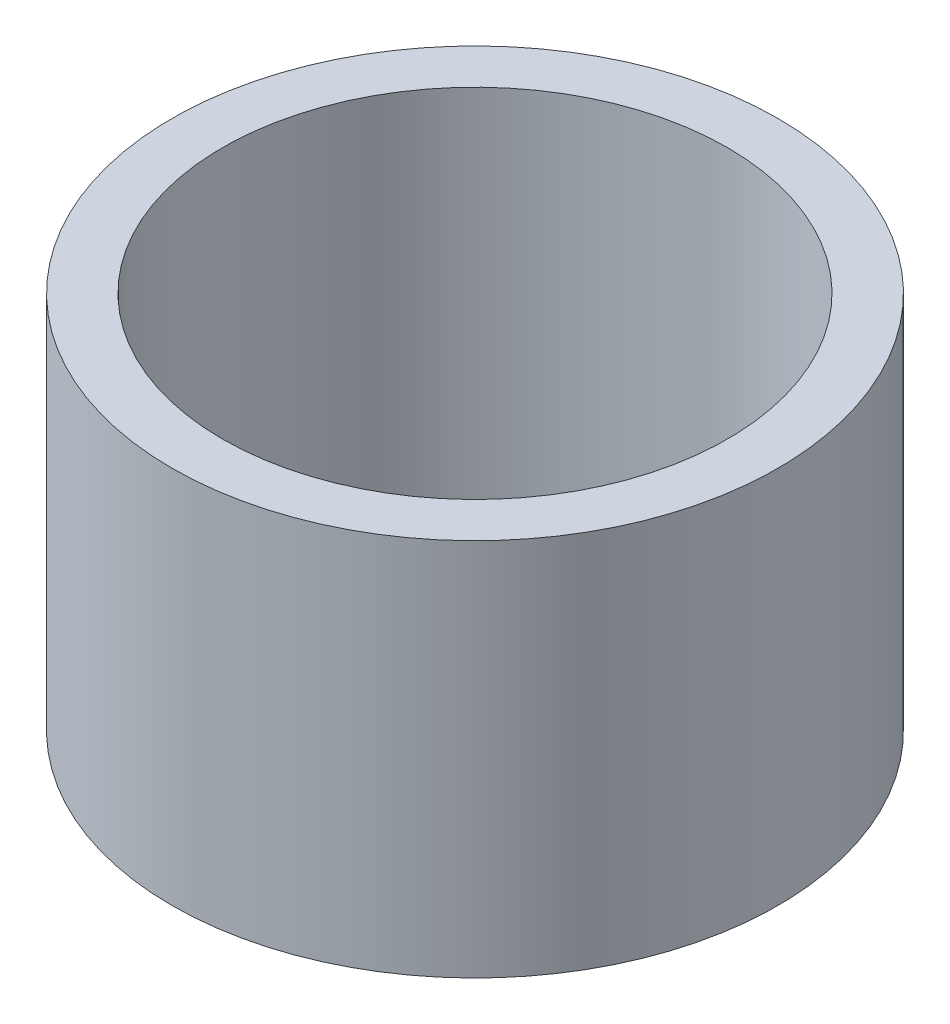
ISO-10303-21;
HEADER;
FILE_DESCRIPTION(('STEP AP214'),'2;1');
FILE_NAME('part.step','',(''),(''),'','','');
FILE_SCHEMA(('AUTOMOTIVE_DESIGN { 1 0 10303 214 1 1 1 1 }'));
ENDSEC;
DATA;
#1=APPLICATION_CONTEXT('core data for automotive mechanical design processes');
#2=APPLICATION_PROTOCOL_DEFINITION('international standard','automotive_design',2000,#1);
#3=PRODUCT_CONTEXT('',#1,'mechanical');
#4=PRODUCT('Part','Part','',(#3));
#5=PRODUCT_RELATED_PRODUCT_CATEGORY('part','',(#4));
#6=PRODUCT_DEFINITION_FORMATION('','',#4);
#7=PRODUCT_DEFINITION_CONTEXT('part definition',#1,'design');
#8=PRODUCT_DEFINITION('design','',#6,#7);
#9=PRODUCT_DEFINITION_SHAPE('','',#8);
#10=(LENGTH_UNIT() NAMED_UNIT(*) SI_UNIT(.MILLI.,.METRE.));
#11=(NAMED_UNIT(*) PLANE_ANGLE_UNIT() SI_UNIT($,.RADIAN.));
#12=(NAMED_UNIT(*) SI_UNIT($,.STERADIAN.) SOLID_ANGLE_UNIT());
#13=UNCERTAINTY_MEASURE_WITH_UNIT(LENGTH_MEASURE(1.E-05),#10,'distance_accuracy_value','');
#14=(GEOMETRIC_REPRESENTATION_CONTEXT(3) GLOBAL_UNCERTAINTY_ASSIGNED_CONTEXT((#13)) GLOBAL_UNIT_ASSIGNED_CONTEXT((#10,
#11,#12)) REPRESENTATION_CONTEXT('',''));
#15=CARTESIAN_POINT('',(0.,0.,0.));
#16=DIRECTION('',(0.,0.,1.));
#17=DIRECTION('',(1.,0.,0.));
#18=AXIS2_PLACEMENT_3D('',#15,#16,#17);
#19=CARTESIAN_POINT('',(0.,600.,0.));
#20=DIRECTION('',(0.,1.,0.));
#21=DIRECTION('',(0.,0.,1.));
#22=AXIS2_PLACEMENT_3D('',#19,#20,#21);
#23=PLANE('',#22);
#24=CARTESIAN_POINT('',(0.,600.,0.));
#25=DIRECTION('',(0.,1.,0.));
#26=DIRECTION('',(0.,0.,1.));
#27=AXIS2_PLACEMENT_3D('',#24,#25,#26);
#28=CIRCLE('',#27,480.);
#29=CARTESIAN_POINT('',(0.,600.,480.));
#30=VERTEX_POINT('',#29);
#31=EDGE_CURVE('E10',#30,#30,#28,.T.);
#32=ORIENTED_EDGE('',*,*,#31,.T.);
#33=EDGE_LOOP('',(#32));
#34=FACE_BOUND('',#33,.T.);
#35=CARTESIAN_POINT('',(0.,600.,0.));
#36=DIRECTION('',(0.,1.,0.));
#37=DIRECTION('',(0.,0.,1.));
#38=AXIS2_PLACEMENT_3D('',#35,#36,#37);
#39=CIRCLE('',#38,400.);
#40=CARTESIAN_POINT('',(0.,600.,400.));
#41=VERTEX_POINT('',#40);
#42=EDGE_CURVE('E42',#41,#41,#39,.T.);
#43=ORIENTED_EDGE('',*,*,#42,.F.);
#44=EDGE_LOOP('',(#43));
#45=FACE_BOUND('',#44,.T.);
#46=ADVANCED_FACE('F31',(#34,#45),#23,.T.);
#47=CARTESIAN_POINT('',(0.,0.,0.));
#48=DIRECTION('',(0.,1.,0.));
#49=DIRECTION('',(0.,0.,1.));
#50=AXIS2_PLACEMENT_3D('',#47,#48,#49);
#51=PLANE('',#50);
#52=CARTESIAN_POINT('',(0.,0.,0.));
#53=DIRECTION('',(0.,1.,0.));
#54=DIRECTION('',(0.,0.,1.));
#55=AXIS2_PLACEMENT_3D('',#52,#53,#54);
#56=CIRCLE('',#55,480.);
#57=CARTESIAN_POINT('',(0.,0.,480.));
#58=VERTEX_POINT('',#57);
#59=EDGE_CURVE('E35',#58,#58,#56,.T.);
#60=ORIENTED_EDGE('',*,*,#59,.F.);
#61=EDGE_LOOP('',(#60));
#62=FACE_BOUND('',#61,.T.);
#63=CARTESIAN_POINT('',(0.,0.,0.));
#64=DIRECTION('',(0.,1.,0.));
#65=DIRECTION('',(0.,0.,1.));
#66=AXIS2_PLACEMENT_3D('',#63,#64,#65);
#67=CIRCLE('',#66,400.);
#68=CARTESIAN_POINT('',(0.,0.,400.));
#69=VERTEX_POINT('',#68);
#70=EDGE_CURVE('E44',#69,#69,#67,.T.);
#71=ORIENTED_EDGE('',*,*,#70,.T.);
#72=EDGE_LOOP('',(#71));
#73=FACE_BOUND('',#72,.T.);
#74=ADVANCED_FACE('F54',(#62,#73),#51,.F.);
#75=CARTESIAN_POINT('',(0.,600.,0.));
#76=DIRECTION('',(0.,-1.,0.));
#77=DIRECTION('',(0.,0.,-1.));
#78=AXIS2_PLACEMENT_3D('',#75,#76,#77);
#79=CYLINDRICAL_SURFACE('',#78,480.);
#80=ORIENTED_EDGE('',*,*,#31,.F.);
#81=EDGE_LOOP('',(#80));
#82=FACE_BOUND('',#81,.T.);
#83=ORIENTED_EDGE('',*,*,#59,.T.);
#84=EDGE_LOOP('',(#83));
#85=FACE_BOUND('',#84,.T.);
#86=ADVANCED_FACE('F33',(#82,#85),#79,.T.);
#87=CARTESIAN_POINT('',(0.,600.,0.));
#88=DIRECTION('',(0.,-1.,0.));
#89=DIRECTION('',(0.,0.,-1.));
#90=AXIS2_PLACEMENT_3D('',#87,#88,#89);
#91=CYLINDRICAL_SURFACE('',#90,400.);
#92=ORIENTED_EDGE('',*,*,#42,.T.);
#93=EDGE_LOOP('',(#92));
#94=FACE_BOUND('',#93,.T.);
#95=ORIENTED_EDGE('',*,*,#70,.F.);
#96=EDGE_LOOP('',(#95));
#97=FACE_BOUND('',#96,.T.);
#98=ADVANCED_FACE('F50',(#94,#97),#91,.F.);
#99=CLOSED_SHELL('',(#46,#74,#86,#98));
#100=MANIFOLD_SOLID_BREP('B2',#99);
#101=ADVANCED_BREP_SHAPE_REPRESENTATION('',(#18,#100),#14);
#102=SHAPE_DEFINITION_REPRESENTATION(#9,#101);
ENDSEC;
END-ISO-10303-21;
